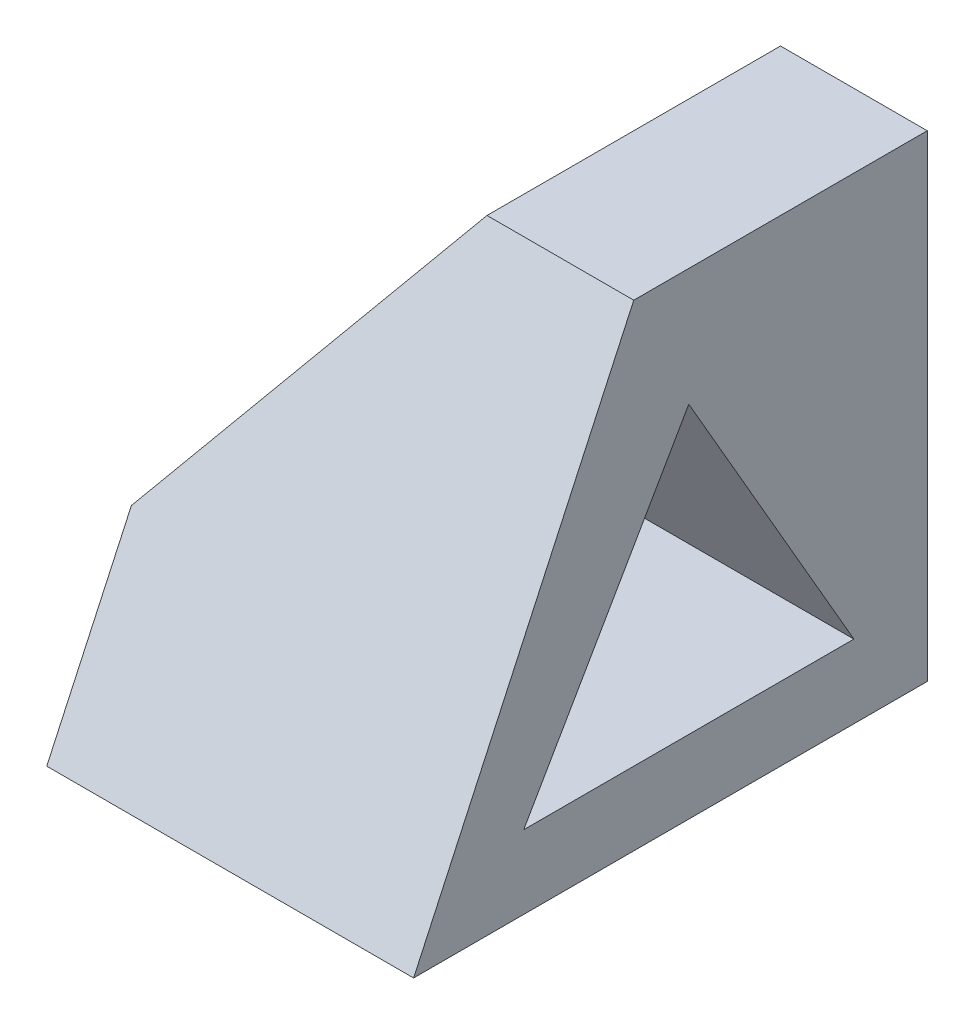
ISO-10303-21;
HEADER;
FILE_DESCRIPTION(('STEP AP214'),'2;1');
FILE_NAME('part.step','',(''),(''),'','','');
FILE_SCHEMA(('AUTOMOTIVE_DESIGN { 1 0 10303 214 1 1 1 1 }'));
ENDSEC;
DATA;
#1=APPLICATION_CONTEXT('core data for automotive mechanical design processes');
#2=APPLICATION_PROTOCOL_DEFINITION('international standard','automotive_design',2000,#1);
#3=PRODUCT_CONTEXT('',#1,'mechanical');
#4=PRODUCT('Part','Part','',(#3));
#5=PRODUCT_RELATED_PRODUCT_CATEGORY('part','',(#4));
#6=PRODUCT_DEFINITION_FORMATION('','',#4);
#7=PRODUCT_DEFINITION_CONTEXT('part definition',#1,'design');
#8=PRODUCT_DEFINITION('design','',#6,#7);
#9=PRODUCT_DEFINITION_SHAPE('','',#8);
#10=(LENGTH_UNIT() NAMED_UNIT(*) SI_UNIT(.MILLI.,.METRE.));
#11=(NAMED_UNIT(*) PLANE_ANGLE_UNIT() SI_UNIT($,.RADIAN.));
#12=(NAMED_UNIT(*) SI_UNIT($,.STERADIAN.) SOLID_ANGLE_UNIT());
#13=UNCERTAINTY_MEASURE_WITH_UNIT(LENGTH_MEASURE(1.E-05),#10,'distance_accuracy_value','');
#14=(GEOMETRIC_REPRESENTATION_CONTEXT(3) GLOBAL_UNCERTAINTY_ASSIGNED_CONTEXT((#13)) GLOBAL_UNIT_ASSIGNED_CONTEXT((#10,
#11,#12)) REPRESENTATION_CONTEXT('',''));
#15=CARTESIAN_POINT('',(0.,0.,0.));
#16=DIRECTION('',(0.,0.,1.));
#17=DIRECTION('',(1.,0.,0.));
#18=AXIS2_PLACEMENT_3D('',#15,#16,#17);
#19=CARTESIAN_POINT('',(0.,0.,70.));
#20=DIRECTION('',(1.,0.,0.));
#21=DIRECTION('',(0.,0.,-1.));
#22=AXIS2_PLACEMENT_3D('',#19,#20,#21);
#23=PLANE('',#22);
#24=DIRECTION('',(0.,0.,-1.));
#25=VECTOR('',#24,1.);
#26=CARTESIAN_POINT('',(0.,25.,70.));
#27=LINE('',#26,#25);
#28=CARTESIAN_POINT('',(0.,25.,58.4615384615385));
#29=VERTEX_POINT('',#28);
#30=CARTESIAN_POINT('',(0.,25.,46.3397459621556));
#31=VERTEX_POINT('',#30);
#32=EDGE_CURVE('E158',#29,#31,#27,.T.);
#33=ORIENTED_EDGE('',*,*,#32,.T.);
#34=DIRECTION('',(0.,-0.866025403784439,0.5));
#35=VECTOR('',#34,1.);
#36=CARTESIAN_POINT('',(0.,9.99999999999999,55.));
#37=LINE('',#36,#35);
#38=CARTESIAN_POINT('',(0.,9.99999999999999,55.));
#39=VERTEX_POINT('',#38);
#40=EDGE_CURVE('E119',#31,#39,#37,.T.);
#41=ORIENTED_EDGE('',*,*,#40,.T.);
#42=DIRECTION('',(0.,0.,-1.));
#43=VECTOR('',#42,1.);
#44=CARTESIAN_POINT('',(0.,10.,10.));
#45=LINE('',#44,#43);
#46=CARTESIAN_POINT('',(0.,10.,10.));
#47=VERTEX_POINT('',#46);
#48=EDGE_CURVE('E122',#39,#47,#45,.T.);
#49=ORIENTED_EDGE('',*,*,#48,.T.);
#50=DIRECTION('',(0.,0.866025403784438,0.5));
#51=VECTOR('',#50,1.);
#52=CARTESIAN_POINT('',(0.,48.9711431702997,32.5));
#53=LINE('',#52,#51);
#54=CARTESIAN_POINT('',(0.,25.,18.6602540378444));
#55=VERTEX_POINT('',#54);
#56=EDGE_CURVE('E106',#47,#55,#53,.T.);
#57=ORIENTED_EDGE('',*,*,#56,.T.);
#58=CARTESIAN_POINT('',(0.,25.,0.));
#59=VERTEX_POINT('',#58);
#60=EDGE_CURVE('E157',#55,#59,#27,.T.);
#61=ORIENTED_EDGE('',*,*,#60,.T.);
#62=DIRECTION('',(0.,-1.,0.));
#63=VECTOR('',#62,1.);
#64=CARTESIAN_POINT('',(0.,0.,0.));
#65=LINE('',#64,#63);
#66=CARTESIAN_POINT('',(0.,0.,0.));
#67=VERTEX_POINT('',#66);
#68=EDGE_CURVE('E141',#59,#67,#65,.T.);
#69=ORIENTED_EDGE('',*,*,#68,.T.);
#70=DIRECTION('',(0.,0.,-1.));
#71=VECTOR('',#70,1.);
#72=CARTESIAN_POINT('',(0.,0.,70.));
#73=LINE('',#72,#71);
#74=CARTESIAN_POINT('',(0.,0.,70.));
#75=VERTEX_POINT('',#74);
#76=EDGE_CURVE('E168',#75,#67,#73,.T.);
#77=ORIENTED_EDGE('',*,*,#76,.F.);
#78=DIRECTION('',(0.,0.907959384500452,-0.419058177461747));
#79=VECTOR('',#78,1.);
#80=CARTESIAN_POINT('',(0.,65.,40.));
#81=LINE('',#80,#79);
#82=EDGE_CURVE('E132',#75,#29,#81,.T.);
#83=ORIENTED_EDGE('',*,*,#82,.T.);
#84=EDGE_LOOP('',(#33,#41,#49,#57,#61,#69,#77,#83));
#85=FACE_BOUND('',#84,.T.);
#86=ADVANCED_FACE('F32',(#85),#23,.F.);
#87=CARTESIAN_POINT('',(0.,0.,70.));
#88=DIRECTION('',(0.,1.,0.));
#89=DIRECTION('',(0.,0.,1.));
#90=AXIS2_PLACEMENT_3D('',#87,#88,#89);
#91=PLANE('',#90);
#92=DIRECTION('',(1.,0.,0.));
#93=VECTOR('',#92,1.);
#94=CARTESIAN_POINT('',(0.,0.,0.));
#95=LINE('',#94,#93);
#96=CARTESIAN_POINT('',(50.,0.,0.));
#97=VERTEX_POINT('',#96);
#98=EDGE_CURVE('E144',#67,#97,#95,.T.);
#99=ORIENTED_EDGE('',*,*,#98,.T.);
#100=DIRECTION('',(0.,0.,-1.));
#101=VECTOR('',#100,1.);
#102=CARTESIAN_POINT('',(50.,0.,70.));
#103=LINE('',#102,#101);
#104=CARTESIAN_POINT('',(50.,0.,70.));
#105=VERTEX_POINT('',#104);
#106=EDGE_CURVE('E165',#105,#97,#103,.T.);
#107=ORIENTED_EDGE('',*,*,#106,.F.);
#108=DIRECTION('',(1.,0.,0.));
#109=VECTOR('',#108,1.);
#110=CARTESIAN_POINT('',(0.,0.,70.));
#111=LINE('',#110,#109);
#112=EDGE_CURVE('E155',#75,#105,#111,.T.);
#113=ORIENTED_EDGE('',*,*,#112,.F.);
#114=ORIENTED_EDGE('',*,*,#76,.T.);
#115=EDGE_LOOP('',(#99,#107,#113,#114));
#116=FACE_BOUND('',#115,.T.);
#117=ADVANCED_FACE('F190',(#116),#91,.F.);
#118=CARTESIAN_POINT('',(50.,0.,70.));
#119=DIRECTION('',(-1.,0.,0.));
#120=DIRECTION('',(0.,0.,1.));
#121=AXIS2_PLACEMENT_3D('',#118,#119,#120);
#122=PLANE('',#121);
#123=DIRECTION('',(0.,0.,-1.));
#124=VECTOR('',#123,1.);
#125=CARTESIAN_POINT('',(50.,10.,10.));
#126=LINE('',#125,#124);
#127=CARTESIAN_POINT('',(50.,9.99999999999999,55.));
#128=VERTEX_POINT('',#127);
#129=CARTESIAN_POINT('',(50.,10.,10.));
#130=VERTEX_POINT('',#129);
#131=EDGE_CURVE('E113',#128,#130,#126,.T.);
#132=ORIENTED_EDGE('',*,*,#131,.F.);
#133=DIRECTION('',(0.,-0.866025403784439,0.5));
#134=VECTOR('',#133,1.);
#135=CARTESIAN_POINT('',(50.,9.99999999999999,55.));
#136=LINE('',#135,#134);
#137=CARTESIAN_POINT('',(50.,48.9711431702997,32.5));
#138=VERTEX_POINT('',#137);
#139=EDGE_CURVE('E46',#138,#128,#136,.T.);
#140=ORIENTED_EDGE('',*,*,#139,.F.);
#141=DIRECTION('',(0.,0.866025403784438,0.5));
#142=VECTOR('',#141,1.);
#143=CARTESIAN_POINT('',(50.,48.9711431702997,32.5));
#144=LINE('',#143,#142);
#145=EDGE_CURVE('E104',#130,#138,#144,.T.);
#146=ORIENTED_EDGE('',*,*,#145,.F.);
#147=EDGE_LOOP('',(#132,#140,#146));
#148=FACE_BOUND('',#147,.T.);
#149=DIRECTION('',(0.,0.,-1.));
#150=VECTOR('',#149,1.);
#151=CARTESIAN_POINT('',(50.,65.,70.));
#152=LINE('',#151,#150);
#153=CARTESIAN_POINT('',(50.,65.,40.));
#154=VERTEX_POINT('',#153);
#155=CARTESIAN_POINT('',(50.,65.,0.));
#156=VERTEX_POINT('',#155);
#157=EDGE_CURVE('E163',#154,#156,#152,.T.);
#158=ORIENTED_EDGE('',*,*,#157,.F.);
#159=DIRECTION('',(0.,0.907959384500452,-0.419058177461747));
#160=VECTOR('',#159,1.);
#161=CARTESIAN_POINT('',(50.,65.,40.));
#162=LINE('',#161,#160);
#163=EDGE_CURVE('E128',#105,#154,#162,.T.);
#164=ORIENTED_EDGE('',*,*,#163,.F.);
#165=ORIENTED_EDGE('',*,*,#106,.T.);
#166=DIRECTION('',(0.,1.,0.));
#167=VECTOR('',#166,1.);
#168=CARTESIAN_POINT('',(50.,0.,0.));
#169=LINE('',#168,#167);
#170=EDGE_CURVE('E146',#97,#156,#169,.T.);
#171=ORIENTED_EDGE('',*,*,#170,.T.);
#172=EDGE_LOOP('',(#158,#164,#165,#171));
#173=FACE_BOUND('',#172,.T.);
#174=ADVANCED_FACE('F117',(#148,#173),#122,.F.);
#175=CARTESIAN_POINT('',(30.,65.,70.));
#176=DIRECTION('',(0.,-1.,0.));
#177=DIRECTION('',(0.,0.,-1.));
#178=AXIS2_PLACEMENT_3D('',#175,#176,#177);
#179=PLANE('',#178);
#180=DIRECTION('',(0.,0.,-1.));
#181=VECTOR('',#180,1.);
#182=CARTESIAN_POINT('',(30.,65.,70.));
#183=LINE('',#182,#181);
#184=CARTESIAN_POINT('',(30.,65.,40.));
#185=VERTEX_POINT('',#184);
#186=CARTESIAN_POINT('',(30.,65.,0.));
#187=VERTEX_POINT('',#186);
#188=EDGE_CURVE('E161',#185,#187,#183,.T.);
#189=ORIENTED_EDGE('',*,*,#188,.F.);
#190=DIRECTION('',(1.,0.,0.));
#191=VECTOR('',#190,1.);
#192=CARTESIAN_POINT('',(0.,65.,40.));
#193=LINE('',#192,#191);
#194=EDGE_CURVE('E135',#185,#154,#193,.T.);
#195=ORIENTED_EDGE('',*,*,#194,.T.);
#196=ORIENTED_EDGE('',*,*,#157,.T.);
#197=DIRECTION('',(-1.,0.,0.));
#198=VECTOR('',#197,1.);
#199=CARTESIAN_POINT('',(30.,65.,0.));
#200=LINE('',#199,#198);
#201=EDGE_CURVE('E149',#156,#187,#200,.T.);
#202=ORIENTED_EDGE('',*,*,#201,.T.);
#203=EDGE_LOOP('',(#189,#195,#196,#202));
#204=FACE_BOUND('',#203,.T.);
#205=ADVANCED_FACE('F198',(#204),#179,.F.);
#206=CARTESIAN_POINT('',(30.,65.,70.));
#207=DIRECTION('',(0.8,-0.6,0.));
#208=DIRECTION('',(0.6,0.8,0.));
#209=AXIS2_PLACEMENT_3D('',#206,#207,#208);
#210=PLANE('',#209);
#211=DIRECTION('',(0.544704779401922,0.726273039202563,0.419313934688767));
#212=VECTOR('',#211,1.);
#213=CARTESIAN_POINT('',(36.4513910049406,73.6018546732541,46.7205479165627));
#214=LINE('',#213,#212);
#215=CARTESIAN_POINT('',(17.9783573777248,48.9711431702997,32.5));
#216=VERTEX_POINT('',#215);
#217=EDGE_CURVE('E39',#55,#216,#214,.T.);
#218=ORIENTED_EDGE('',*,*,#217,.T.);
#219=DIRECTION('',(-0.544704779401922,-0.726273039202563,0.419313934688767));
#220=VECTOR('',#219,1.);
#221=CARTESIAN_POINT('',(19.3212181828308,50.7616242437744,31.4662652702505));
#222=LINE('',#221,#220);
#223=EDGE_CURVE('E11',#216,#31,#222,.T.);
#224=ORIENTED_EDGE('',*,*,#223,.T.);
#225=ORIENTED_EDGE('',*,*,#32,.F.);
#226=DIRECTION('',(0.562857884483633,0.75047717931151,-0.346374082759159));
#227=VECTOR('',#226,1.);
#228=CARTESIAN_POINT('',(24.1512184961466,57.2016246615289,43.5992501562175));
#229=LINE('',#228,#227);
#230=EDGE_CURVE('E138',#29,#185,#229,.T.);
#231=ORIENTED_EDGE('',*,*,#230,.T.);
#232=ORIENTED_EDGE('',*,*,#188,.T.);
#233=DIRECTION('',(-0.6,-0.8,0.));
#234=VECTOR('',#233,1.);
#235=CARTESIAN_POINT('',(30.,65.,0.));
#236=LINE('',#235,#234);
#237=EDGE_CURVE('E152',#187,#59,#236,.T.);
#238=ORIENTED_EDGE('',*,*,#237,.T.);
#239=ORIENTED_EDGE('',*,*,#60,.F.);
#240=EDGE_LOOP('',(#218,#224,#225,#231,#232,#238,#239));
#241=FACE_BOUND('',#240,.T.);
#242=ADVANCED_FACE('F173',(#241),#210,.F.);
#243=CARTESIAN_POINT('',(0.,65.,0.));
#244=DIRECTION('',(0.,0.,-1.));
#245=DIRECTION('',(-1.,0.,0.));
#246=AXIS2_PLACEMENT_3D('',#243,#244,#245);
#247=PLANE('',#246);
#248=ORIENTED_EDGE('',*,*,#68,.F.);
#249=ORIENTED_EDGE('',*,*,#237,.F.);
#250=ORIENTED_EDGE('',*,*,#201,.F.);
#251=ORIENTED_EDGE('',*,*,#170,.F.);
#252=ORIENTED_EDGE('',*,*,#98,.F.);
#253=EDGE_LOOP('',(#248,#249,#250,#251,#252));
#254=FACE_BOUND('',#253,.T.);
#255=ADVANCED_FACE('F185',(#254),#247,.T.);
#256=CARTESIAN_POINT('',(0.,65.,40.));
#257=DIRECTION('',(0.,-0.419058177461747,-0.907959384500452));
#258=DIRECTION('',(0.,0.907959384500452,-0.419058177461747));
#259=AXIS2_PLACEMENT_3D('',#256,#257,#258);
#260=PLANE('',#259);
#261=ORIENTED_EDGE('',*,*,#82,.F.);
#262=ORIENTED_EDGE('',*,*,#112,.T.);
#263=ORIENTED_EDGE('',*,*,#163,.T.);
#264=ORIENTED_EDGE('',*,*,#194,.F.);
#265=ORIENTED_EDGE('',*,*,#230,.F.);
#266=EDGE_LOOP('',(#261,#262,#263,#264,#265));
#267=FACE_BOUND('',#266,.T.);
#268=ADVANCED_FACE('F178',(#267),#260,.F.);
#269=CARTESIAN_POINT('',(0.,9.99999999999999,55.));
#270=DIRECTION('',(0.,0.5,0.866025403784439));
#271=DIRECTION('',(0.,-0.866025403784439,0.5));
#272=AXIS2_PLACEMENT_3D('',#269,#270,#271);
#273=PLANE('',#272);
#274=DIRECTION('',(1.,0.,0.));
#275=VECTOR('',#274,1.);
#276=CARTESIAN_POINT('',(0.,48.9711431702997,32.5));
#277=LINE('',#276,#275);
#278=EDGE_CURVE('E53',#216,#138,#277,.T.);
#279=ORIENTED_EDGE('',*,*,#278,.T.);
#280=ORIENTED_EDGE('',*,*,#139,.T.);
#281=DIRECTION('',(1.,0.,0.));
#282=VECTOR('',#281,1.);
#283=CARTESIAN_POINT('',(0.,9.99999999999999,55.));
#284=LINE('',#283,#282);
#285=EDGE_CURVE('E110',#39,#128,#284,.T.);
#286=ORIENTED_EDGE('',*,*,#285,.F.);
#287=ORIENTED_EDGE('',*,*,#40,.F.);
#288=ORIENTED_EDGE('',*,*,#223,.F.);
#289=EDGE_LOOP('',(#279,#280,#286,#287,#288));
#290=FACE_BOUND('',#289,.T.);
#291=ADVANCED_FACE('F176',(#290),#273,.F.);
#292=CARTESIAN_POINT('',(0.,48.9711431702997,32.5));
#293=DIRECTION('',(0.,0.5,-0.866025403784438));
#294=DIRECTION('',(0.,0.866025403784439,0.5));
#295=AXIS2_PLACEMENT_3D('',#292,#293,#294);
#296=PLANE('',#295);
#297=ORIENTED_EDGE('',*,*,#56,.F.);
#298=DIRECTION('',(1.,0.,0.));
#299=VECTOR('',#298,1.);
#300=CARTESIAN_POINT('',(0.,10.,10.));
#301=LINE('',#300,#299);
#302=EDGE_CURVE('E100',#47,#130,#301,.T.);
#303=ORIENTED_EDGE('',*,*,#302,.T.);
#304=ORIENTED_EDGE('',*,*,#145,.T.);
#305=ORIENTED_EDGE('',*,*,#278,.F.);
#306=ORIENTED_EDGE('',*,*,#217,.F.);
#307=EDGE_LOOP('',(#297,#303,#304,#305,#306));
#308=FACE_BOUND('',#307,.T.);
#309=ADVANCED_FACE('F102',(#308),#296,.F.);
#310=CARTESIAN_POINT('',(0.,10.,10.));
#311=DIRECTION('',(0.,-1.,0.));
#312=DIRECTION('',(0.,0.,-1.));
#313=AXIS2_PLACEMENT_3D('',#310,#311,#312);
#314=PLANE('',#313);
#315=ORIENTED_EDGE('',*,*,#131,.T.);
#316=ORIENTED_EDGE('',*,*,#302,.F.);
#317=ORIENTED_EDGE('',*,*,#48,.F.);
#318=ORIENTED_EDGE('',*,*,#285,.T.);
#319=EDGE_LOOP('',(#315,#316,#317,#318));
#320=FACE_BOUND('',#319,.T.);
#321=ADVANCED_FACE('F114',(#320),#314,.F.);
#322=CLOSED_SHELL('',(#86,#117,#174,#205,#242,#255,#268,#291,#309,#321));
#323=MANIFOLD_SOLID_BREP('B2',#322);
#324=ADVANCED_BREP_SHAPE_REPRESENTATION('',(#18,#323),#14);
#325=SHAPE_DEFINITION_REPRESENTATION(#9,#324);
ENDSEC;
END-ISO-10303-21;
